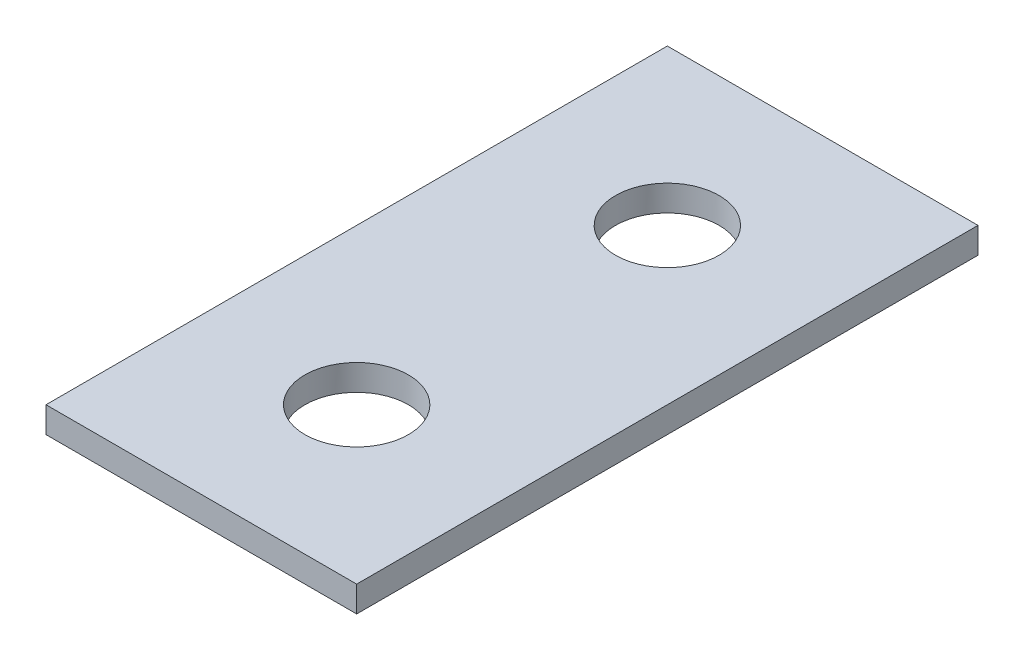
ISO-10303-21;
HEADER;
FILE_DESCRIPTION(('STEP AP214'),'2;1');
FILE_NAME('part.step','',(''),(''),'','','');
FILE_SCHEMA(('AUTOMOTIVE_DESIGN { 1 0 10303 214 1 1 1 1 }'));
ENDSEC;
DATA;
#1=APPLICATION_CONTEXT('core data for automotive mechanical design processes');
#2=APPLICATION_PROTOCOL_DEFINITION('international standard','automotive_design',2000,#1);
#3=PRODUCT_CONTEXT('',#1,'mechanical');
#4=PRODUCT('Part','Part','',(#3));
#5=PRODUCT_RELATED_PRODUCT_CATEGORY('part','',(#4));
#6=PRODUCT_DEFINITION_FORMATION('','',#4);
#7=PRODUCT_DEFINITION_CONTEXT('part definition',#1,'design');
#8=PRODUCT_DEFINITION('design','',#6,#7);
#9=PRODUCT_DEFINITION_SHAPE('','',#8);
#10=(LENGTH_UNIT() NAMED_UNIT(*) SI_UNIT(.MILLI.,.METRE.));
#11=(NAMED_UNIT(*) PLANE_ANGLE_UNIT() SI_UNIT($,.RADIAN.));
#12=(NAMED_UNIT(*) SI_UNIT($,.STERADIAN.) SOLID_ANGLE_UNIT());
#13=UNCERTAINTY_MEASURE_WITH_UNIT(LENGTH_MEASURE(1.E-05),#10,'distance_accuracy_value','');
#14=(GEOMETRIC_REPRESENTATION_CONTEXT(3) GLOBAL_UNCERTAINTY_ASSIGNED_CONTEXT((#13)) GLOBAL_UNIT_ASSIGNED_CONTEXT((#10,
#11,#12)) REPRESENTATION_CONTEXT('',''));
#15=CARTESIAN_POINT('',(0.,0.,0.));
#16=DIRECTION('',(0.,0.,1.));
#17=DIRECTION('',(1.,0.,0.));
#18=AXIS2_PLACEMENT_3D('',#15,#16,#17);
#19=CARTESIAN_POINT('',(0.,6.35,0.));
#20=DIRECTION('',(1.,0.,0.));
#21=DIRECTION('',(0.,0.,-1.));
#22=AXIS2_PLACEMENT_3D('',#19,#20,#21);
#23=PLANE('',#22);
#24=DIRECTION('',(0.,0.,1.));
#25=VECTOR('',#24,1.);
#26=CARTESIAN_POINT('',(0.,0.,0.));
#27=LINE('',#26,#25);
#28=CARTESIAN_POINT('',(0.,0.,-152.4));
#29=VERTEX_POINT('',#28);
#30=CARTESIAN_POINT('',(0.,0.,0.));
#31=VERTEX_POINT('',#30);
#32=EDGE_CURVE('E82',#29,#31,#27,.T.);
#33=ORIENTED_EDGE('',*,*,#32,.T.);
#34=DIRECTION('',(0.,-1.,0.));
#35=VECTOR('',#34,1.);
#36=CARTESIAN_POINT('',(0.,6.35,0.));
#37=LINE('',#36,#35);
#38=CARTESIAN_POINT('',(0.,6.35,0.));
#39=VERTEX_POINT('',#38);
#40=EDGE_CURVE('E11',#39,#31,#37,.T.);
#41=ORIENTED_EDGE('',*,*,#40,.F.);
#42=DIRECTION('',(0.,0.,1.));
#43=VECTOR('',#42,1.);
#44=CARTESIAN_POINT('',(0.,6.35,0.));
#45=LINE('',#44,#43);
#46=CARTESIAN_POINT('',(0.,6.35,-152.4));
#47=VERTEX_POINT('',#46);
#48=EDGE_CURVE('E69',#47,#39,#45,.T.);
#49=ORIENTED_EDGE('',*,*,#48,.F.);
#50=DIRECTION('',(0.,-1.,0.));
#51=VECTOR('',#50,1.);
#52=CARTESIAN_POINT('',(0.,6.35,-152.4));
#53=LINE('',#52,#51);
#54=EDGE_CURVE('E78',#47,#29,#53,.T.);
#55=ORIENTED_EDGE('',*,*,#54,.T.);
#56=EDGE_LOOP('',(#33,#41,#49,#55));
#57=FACE_BOUND('',#56,.T.);
#58=ADVANCED_FACE('F17',(#57),#23,.F.);
#59=CARTESIAN_POINT('',(0.,6.35,0.));
#60=DIRECTION('',(0.,0.,-1.));
#61=DIRECTION('',(-1.,0.,0.));
#62=AXIS2_PLACEMENT_3D('',#59,#60,#61);
#63=PLANE('',#62);
#64=DIRECTION('',(1.,0.,0.));
#65=VECTOR('',#64,1.);
#66=CARTESIAN_POINT('',(0.,0.,0.));
#67=LINE('',#66,#65);
#68=CARTESIAN_POINT('',(76.2,0.,0.));
#69=VERTEX_POINT('',#68);
#70=EDGE_CURVE('E73',#31,#69,#67,.T.);
#71=ORIENTED_EDGE('',*,*,#70,.T.);
#72=DIRECTION('',(0.,-1.,0.));
#73=VECTOR('',#72,1.);
#74=CARTESIAN_POINT('',(76.2,6.35,0.));
#75=LINE('',#74,#73);
#76=CARTESIAN_POINT('',(76.2,6.35,0.));
#77=VERTEX_POINT('',#76);
#78=EDGE_CURVE('E26',#77,#69,#75,.T.);
#79=ORIENTED_EDGE('',*,*,#78,.F.);
#80=DIRECTION('',(1.,0.,0.));
#81=VECTOR('',#80,1.);
#82=CARTESIAN_POINT('',(0.,6.35,0.));
#83=LINE('',#82,#81);
#84=EDGE_CURVE('E64',#39,#77,#83,.T.);
#85=ORIENTED_EDGE('',*,*,#84,.F.);
#86=ORIENTED_EDGE('',*,*,#40,.T.);
#87=EDGE_LOOP('',(#71,#79,#85,#86));
#88=FACE_BOUND('',#87,.T.);
#89=ADVANCED_FACE('F72',(#88),#63,.F.);
#90=CARTESIAN_POINT('',(76.2,6.35,0.));
#91=DIRECTION('',(-1.,0.,0.));
#92=DIRECTION('',(0.,0.,1.));
#93=AXIS2_PLACEMENT_3D('',#90,#91,#92);
#94=PLANE('',#93);
#95=DIRECTION('',(0.,0.,-1.));
#96=VECTOR('',#95,1.);
#97=CARTESIAN_POINT('',(76.2,0.,0.));
#98=LINE('',#97,#96);
#99=CARTESIAN_POINT('',(76.2,0.,-152.4));
#100=VERTEX_POINT('',#99);
#101=EDGE_CURVE('E51',#69,#100,#98,.T.);
#102=ORIENTED_EDGE('',*,*,#101,.T.);
#103=DIRECTION('',(0.,-1.,0.));
#104=VECTOR('',#103,1.);
#105=CARTESIAN_POINT('',(76.2,6.35,-152.4));
#106=LINE('',#105,#104);
#107=CARTESIAN_POINT('',(76.2,6.35,-152.4));
#108=VERTEX_POINT('',#107);
#109=EDGE_CURVE('E74',#108,#100,#106,.T.);
#110=ORIENTED_EDGE('',*,*,#109,.F.);
#111=DIRECTION('',(0.,0.,-1.));
#112=VECTOR('',#111,1.);
#113=CARTESIAN_POINT('',(76.2,6.35,0.));
#114=LINE('',#113,#112);
#115=EDGE_CURVE('E67',#77,#108,#114,.T.);
#116=ORIENTED_EDGE('',*,*,#115,.F.);
#117=ORIENTED_EDGE('',*,*,#78,.T.);
#118=EDGE_LOOP('',(#102,#110,#116,#117));
#119=FACE_BOUND('',#118,.T.);
#120=ADVANCED_FACE('F76',(#119),#94,.F.);
#121=CARTESIAN_POINT('',(0.,6.35,-152.4));
#122=DIRECTION('',(0.,0.,1.));
#123=DIRECTION('',(1.,0.,0.));
#124=AXIS2_PLACEMENT_3D('',#121,#122,#123);
#125=PLANE('',#124);
#126=DIRECTION('',(-1.,0.,0.));
#127=VECTOR('',#126,1.);
#128=CARTESIAN_POINT('',(0.,0.,-152.4));
#129=LINE('',#128,#127);
#130=EDGE_CURVE('E57',#100,#29,#129,.T.);
#131=ORIENTED_EDGE('',*,*,#130,.T.);
#132=ORIENTED_EDGE('',*,*,#54,.F.);
#133=DIRECTION('',(-1.,0.,0.));
#134=VECTOR('',#133,1.);
#135=CARTESIAN_POINT('',(0.,6.35,-152.4));
#136=LINE('',#135,#134);
#137=EDGE_CURVE('E34',#108,#47,#136,.T.);
#138=ORIENTED_EDGE('',*,*,#137,.F.);
#139=ORIENTED_EDGE('',*,*,#109,.T.);
#140=EDGE_LOOP('',(#131,#132,#138,#139));
#141=FACE_BOUND('',#140,.T.);
#142=ADVANCED_FACE('F90',(#141),#125,.F.);
#143=CARTESIAN_POINT('',(0.,6.35,-152.4));
#144=DIRECTION('',(0.,-1.,0.));
#145=DIRECTION('',(0.,0.,-1.));
#146=AXIS2_PLACEMENT_3D('',#143,#144,#145);
#147=PLANE('',#146);
#148=CARTESIAN_POINT('',(38.1,6.35,-38.1));
#149=DIRECTION('',(0.,1.,0.));
#150=DIRECTION('',(0.,0.,1.));
#151=AXIS2_PLACEMENT_3D('',#148,#149,#150);
#152=CIRCLE('',#151,12.7);
#153=CARTESIAN_POINT('',(38.1,6.35,-25.4));
#154=VERTEX_POINT('',#153);
#155=EDGE_CURVE('E101',#154,#154,#152,.T.);
#156=ORIENTED_EDGE('',*,*,#155,.F.);
#157=EDGE_LOOP('',(#156));
#158=FACE_BOUND('',#157,.T.);
#159=CARTESIAN_POINT('',(38.1,6.35,-114.3));
#160=DIRECTION('',(0.,1.,0.));
#161=DIRECTION('',(0.,0.,1.));
#162=AXIS2_PLACEMENT_3D('',#159,#160,#161);
#163=CIRCLE('',#162,12.7);
#164=CARTESIAN_POINT('',(38.1,6.35,-101.6));
#165=VERTEX_POINT('',#164);
#166=EDGE_CURVE('E98',#165,#165,#163,.T.);
#167=ORIENTED_EDGE('',*,*,#166,.F.);
#168=EDGE_LOOP('',(#167));
#169=FACE_BOUND('',#168,.T.);
#170=ORIENTED_EDGE('',*,*,#48,.T.);
#171=ORIENTED_EDGE('',*,*,#84,.T.);
#172=ORIENTED_EDGE('',*,*,#115,.T.);
#173=ORIENTED_EDGE('',*,*,#137,.T.);
#174=EDGE_LOOP('',(#170,#171,#172,#173));
#175=FACE_BOUND('',#174,.T.);
#176=ADVANCED_FACE('F65',(#158,#169,#175),#147,.F.);
#177=CARTESIAN_POINT('',(0.,0.,-152.4));
#178=DIRECTION('',(0.,-1.,0.));
#179=DIRECTION('',(0.,0.,-1.));
#180=AXIS2_PLACEMENT_3D('',#177,#178,#179);
#181=PLANE('',#180);
#182=CARTESIAN_POINT('',(38.1,0.,-38.1));
#183=DIRECTION('',(0.,-1.,0.));
#184=DIRECTION('',(0.,0.,-1.));
#185=AXIS2_PLACEMENT_3D('',#182,#183,#184);
#186=CIRCLE('',#185,12.7);
#187=CARTESIAN_POINT('',(38.1,0.,-50.8));
#188=VERTEX_POINT('',#187);
#189=EDGE_CURVE('E20',#188,#188,#186,.T.);
#190=ORIENTED_EDGE('',*,*,#189,.F.);
#191=EDGE_LOOP('',(#190));
#192=FACE_BOUND('',#191,.T.);
#193=CARTESIAN_POINT('',(38.1,0.,-114.3));
#194=DIRECTION('',(0.,-1.,0.));
#195=DIRECTION('',(0.,0.,-1.));
#196=AXIS2_PLACEMENT_3D('',#193,#194,#195);
#197=CIRCLE('',#196,12.7);
#198=CARTESIAN_POINT('',(38.1,0.,-127.));
#199=VERTEX_POINT('',#198);
#200=EDGE_CURVE('E85',#199,#199,#197,.T.);
#201=ORIENTED_EDGE('',*,*,#200,.F.);
#202=EDGE_LOOP('',(#201));
#203=FACE_BOUND('',#202,.T.);
#204=ORIENTED_EDGE('',*,*,#32,.F.);
#205=ORIENTED_EDGE('',*,*,#130,.F.);
#206=ORIENTED_EDGE('',*,*,#101,.F.);
#207=ORIENTED_EDGE('',*,*,#70,.F.);
#208=EDGE_LOOP('',(#204,#205,#206,#207));
#209=FACE_BOUND('',#208,.T.);
#210=ADVANCED_FACE('F93',(#192,#203,#209),#181,.T.);
#211=CARTESIAN_POINT('',(38.1,6.35,-114.3));
#212=DIRECTION('',(0.,1.,0.));
#213=DIRECTION('',(0.,0.,1.));
#214=AXIS2_PLACEMENT_3D('',#211,#212,#213);
#215=CYLINDRICAL_SURFACE('',#214,12.7);
#216=ORIENTED_EDGE('',*,*,#200,.T.);
#217=EDGE_LOOP('',(#216));
#218=FACE_BOUND('',#217,.T.);
#219=ORIENTED_EDGE('',*,*,#166,.T.);
#220=EDGE_LOOP('',(#219));
#221=FACE_BOUND('',#220,.T.);
#222=ADVANCED_FACE('F112',(#218,#221),#215,.F.);
#223=CARTESIAN_POINT('',(38.1,6.35,-38.1));
#224=DIRECTION('',(0.,1.,0.));
#225=DIRECTION('',(0.,0.,1.));
#226=AXIS2_PLACEMENT_3D('',#223,#224,#225);
#227=CYLINDRICAL_SURFACE('',#226,12.7);
#228=ORIENTED_EDGE('',*,*,#189,.T.);
#229=EDGE_LOOP('',(#228));
#230=FACE_BOUND('',#229,.T.);
#231=ORIENTED_EDGE('',*,*,#155,.T.);
#232=EDGE_LOOP('',(#231));
#233=FACE_BOUND('',#232,.T.);
#234=ADVANCED_FACE('F108',(#230,#233),#227,.F.);
#235=CLOSED_SHELL('',(#58,#89,#120,#142,#176,#210,#222,#234));
#236=MANIFOLD_SOLID_BREP('B1',#235);
#237=ADVANCED_BREP_SHAPE_REPRESENTATION('',(#18,#236),#14);
#238=SHAPE_DEFINITION_REPRESENTATION(#9,#237);
ENDSEC;
END-ISO-10303-21;
